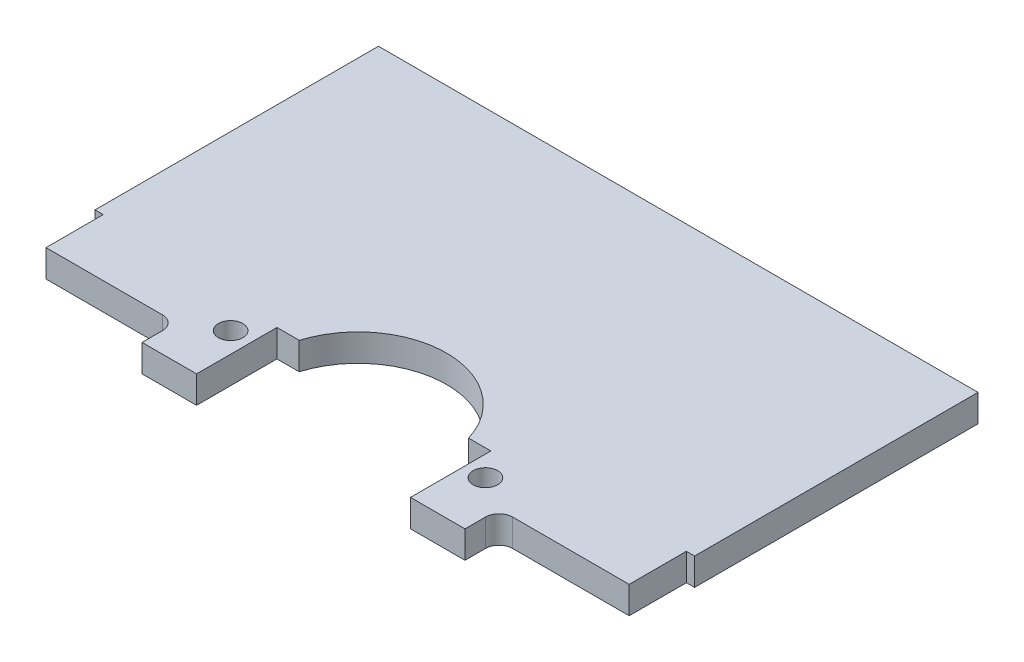
ISO-10303-21;
HEADER;
FILE_DESCRIPTION(('STEP AP214'),'2;1');
FILE_NAME('part.step','',(''),(''),'','','');
FILE_SCHEMA(('AUTOMOTIVE_DESIGN { 1 0 10303 214 1 1 1 1 }'));
ENDSEC;
DATA;
#1=APPLICATION_CONTEXT('core data for automotive mechanical design processes');
#2=APPLICATION_PROTOCOL_DEFINITION('international standard','automotive_design',2000,#1);
#3=PRODUCT_CONTEXT('',#1,'mechanical');
#4=PRODUCT('Part','Part','',(#3));
#5=PRODUCT_RELATED_PRODUCT_CATEGORY('part','',(#4));
#6=PRODUCT_DEFINITION_FORMATION('','',#4);
#7=PRODUCT_DEFINITION_CONTEXT('part definition',#1,'design');
#8=PRODUCT_DEFINITION('design','',#6,#7);
#9=PRODUCT_DEFINITION_SHAPE('','',#8);
#10=(LENGTH_UNIT() NAMED_UNIT(*) SI_UNIT(.MILLI.,.METRE.));
#11=(NAMED_UNIT(*) PLANE_ANGLE_UNIT() SI_UNIT($,.RADIAN.));
#12=(NAMED_UNIT(*) SI_UNIT($,.STERADIAN.) SOLID_ANGLE_UNIT());
#13=UNCERTAINTY_MEASURE_WITH_UNIT(LENGTH_MEASURE(1.E-05),#10,'distance_accuracy_value','');
#14=(GEOMETRIC_REPRESENTATION_CONTEXT(3) GLOBAL_UNCERTAINTY_ASSIGNED_CONTEXT((#13)) GLOBAL_UNIT_ASSIGNED_CONTEXT((#10,
#11,#12)) REPRESENTATION_CONTEXT('',''));
#15=CARTESIAN_POINT('',(0.,0.,0.));
#16=DIRECTION('',(0.,0.,1.));
#17=DIRECTION('',(1.,0.,0.));
#18=AXIS2_PLACEMENT_3D('',#15,#16,#17);
#19=CARTESIAN_POINT('',(0.,2.54,13.208));
#20=DIRECTION('',(0.,0.,-1.));
#21=DIRECTION('',(-1.,0.,0.));
#22=AXIS2_PLACEMENT_3D('',#19,#20,#21);
#23=PLANE('',#22);
#24=DIRECTION('',(1.,0.,0.));
#25=VECTOR('',#24,1.);
#26=CARTESIAN_POINT('',(0.,0.,13.208));
#27=LINE('',#26,#25);
#28=CARTESIAN_POINT('',(-27.94,0.,13.208));
#29=VERTEX_POINT('',#28);
#30=CARTESIAN_POINT('',(-27.178,0.,13.208));
#31=VERTEX_POINT('',#30);
#32=EDGE_CURVE('E188',#29,#31,#27,.T.);
#33=ORIENTED_EDGE('',*,*,#32,.T.);
#34=DIRECTION('',(0.,-1.,0.));
#35=VECTOR('',#34,1.);
#36=CARTESIAN_POINT('',(-27.178,2.54,13.208));
#37=LINE('',#36,#35);
#38=CARTESIAN_POINT('',(-27.178,2.54,13.208));
#39=VERTEX_POINT('',#38);
#40=EDGE_CURVE('E186',#39,#31,#37,.T.);
#41=ORIENTED_EDGE('',*,*,#40,.F.);
#42=DIRECTION('',(1.,0.,0.));
#43=VECTOR('',#42,1.);
#44=CARTESIAN_POINT('',(0.,2.54,13.208));
#45=LINE('',#44,#43);
#46=CARTESIAN_POINT('',(-27.94,2.54,13.208));
#47=VERTEX_POINT('',#46);
#48=EDGE_CURVE('E171',#47,#39,#45,.T.);
#49=ORIENTED_EDGE('',*,*,#48,.F.);
#50=DIRECTION('',(0.,-1.,0.));
#51=VECTOR('',#50,1.);
#52=CARTESIAN_POINT('',(-27.94,2.54,13.208));
#53=LINE('',#52,#51);
#54=EDGE_CURVE('E236',#47,#29,#53,.T.);
#55=ORIENTED_EDGE('',*,*,#54,.T.);
#56=EDGE_LOOP('',(#33,#41,#49,#55));
#57=FACE_BOUND('',#56,.T.);
#58=ADVANCED_FACE('F33',(#57),#23,.F.);
#59=CARTESIAN_POINT('',(-27.178,2.54,0.));
#60=DIRECTION('',(-1.,0.,0.));
#61=DIRECTION('',(0.,0.,1.));
#62=AXIS2_PLACEMENT_3D('',#59,#60,#61);
#63=PLANE('',#62);
#64=DIRECTION('',(0.,0.,-1.));
#65=VECTOR('',#64,1.);
#66=CARTESIAN_POINT('',(-27.178,0.,0.));
#67=LINE('',#66,#65);
#68=CARTESIAN_POINT('',(-27.178,0.,18.542));
#69=VERTEX_POINT('',#68);
#70=EDGE_CURVE('E238',#69,#31,#67,.T.);
#71=ORIENTED_EDGE('',*,*,#70,.F.);
#72=DIRECTION('',(0.,-1.,0.));
#73=VECTOR('',#72,1.);
#74=CARTESIAN_POINT('',(-27.178,2.54,18.542));
#75=LINE('',#74,#73);
#76=CARTESIAN_POINT('',(-27.178,2.54,18.542));
#77=VERTEX_POINT('',#76);
#78=EDGE_CURVE('E193',#77,#69,#75,.T.);
#79=ORIENTED_EDGE('',*,*,#78,.F.);
#80=DIRECTION('',(0.,0.,-1.));
#81=VECTOR('',#80,1.);
#82=CARTESIAN_POINT('',(-27.178,2.54,0.));
#83=LINE('',#82,#81);
#84=EDGE_CURVE('E177',#77,#39,#83,.T.);
#85=ORIENTED_EDGE('',*,*,#84,.T.);
#86=ORIENTED_EDGE('',*,*,#40,.T.);
#87=EDGE_LOOP('',(#71,#79,#85,#86));
#88=FACE_BOUND('',#87,.T.);
#89=ADVANCED_FACE('F195',(#88),#63,.T.);
#90=CARTESIAN_POINT('',(0.,2.54,18.542));
#91=DIRECTION('',(0.,0.,-1.));
#92=DIRECTION('',(-1.,0.,0.));
#93=AXIS2_PLACEMENT_3D('',#90,#91,#92);
#94=PLANE('',#93);
#95=DIRECTION('',(1.,0.,0.));
#96=VECTOR('',#95,1.);
#97=CARTESIAN_POINT('',(0.,0.,18.542));
#98=LINE('',#97,#96);
#99=CARTESIAN_POINT('',(-16.3195,0.,18.542));
#100=VERTEX_POINT('',#99);
#101=EDGE_CURVE('E241',#69,#100,#98,.T.);
#102=ORIENTED_EDGE('',*,*,#101,.T.);
#103=DIRECTION('',(0.,-1.,0.));
#104=VECTOR('',#103,1.);
#105=CARTESIAN_POINT('',(-16.3195,2.54,18.542));
#106=LINE('',#105,#104);
#107=CARTESIAN_POINT('',(-16.3195,2.54,18.542));
#108=VERTEX_POINT('',#107);
#109=EDGE_CURVE('E321',#100,#108,#106,.F.);
#110=ORIENTED_EDGE('',*,*,#109,.T.);
#111=DIRECTION('',(1.,0.,0.));
#112=VECTOR('',#111,1.);
#113=CARTESIAN_POINT('',(0.,2.54,18.542));
#114=LINE('',#113,#112);
#115=EDGE_CURVE('E197',#77,#108,#114,.T.);
#116=ORIENTED_EDGE('',*,*,#115,.F.);
#117=ORIENTED_EDGE('',*,*,#78,.T.);
#118=EDGE_LOOP('',(#102,#110,#116,#117));
#119=FACE_BOUND('',#118,.T.);
#120=ADVANCED_FACE('F345',(#119),#94,.F.);
#121=CARTESIAN_POINT('',(-15.0495,2.54,0.));
#122=DIRECTION('',(-1.,0.,0.));
#123=DIRECTION('',(0.,0.,1.));
#124=AXIS2_PLACEMENT_3D('',#121,#122,#123);
#125=PLANE('',#124);
#126=DIRECTION('',(0.,0.,-1.));
#127=VECTOR('',#126,1.);
#128=CARTESIAN_POINT('',(-15.0495,2.54,0.));
#129=LINE('',#128,#127);
#130=CARTESIAN_POINT('',(-15.0495,2.54,21.717));
#131=VERTEX_POINT('',#130);
#132=CARTESIAN_POINT('',(-15.0495,2.54,19.812));
#133=VERTEX_POINT('',#132);
#134=EDGE_CURVE('E199',#131,#133,#129,.T.);
#135=ORIENTED_EDGE('',*,*,#134,.T.);
#136=DIRECTION('',(0.,-1.,0.));
#137=VECTOR('',#136,1.);
#138=CARTESIAN_POINT('',(-15.0495,2.54,19.812));
#139=LINE('',#138,#137);
#140=CARTESIAN_POINT('',(-15.0495,0.,19.812));
#141=VERTEX_POINT('',#140);
#142=EDGE_CURVE('E192',#133,#141,#139,.T.);
#143=ORIENTED_EDGE('',*,*,#142,.T.);
#144=DIRECTION('',(0.,0.,-1.));
#145=VECTOR('',#144,1.);
#146=CARTESIAN_POINT('',(-15.0495,0.,0.));
#147=LINE('',#146,#145);
#148=CARTESIAN_POINT('',(-15.0495,0.,21.717));
#149=VERTEX_POINT('',#148);
#150=EDGE_CURVE('E244',#149,#141,#147,.T.);
#151=ORIENTED_EDGE('',*,*,#150,.F.);
#152=DIRECTION('',(0.,-1.,0.));
#153=VECTOR('',#152,1.);
#154=CARTESIAN_POINT('',(-15.0495,2.54,21.717));
#155=LINE('',#154,#153);
#156=EDGE_CURVE('E316',#131,#149,#155,.T.);
#157=ORIENTED_EDGE('',*,*,#156,.F.);
#158=EDGE_LOOP('',(#135,#143,#151,#157));
#159=FACE_BOUND('',#158,.T.);
#160=ADVANCED_FACE('F336',(#159),#125,.T.);
#161=CARTESIAN_POINT('',(0.,2.54,21.717));
#162=DIRECTION('',(0.,0.,-1.));
#163=DIRECTION('',(-1.,0.,0.));
#164=AXIS2_PLACEMENT_3D('',#161,#162,#163);
#165=PLANE('',#164);
#166=DIRECTION('',(1.,0.,0.));
#167=VECTOR('',#166,1.);
#168=CARTESIAN_POINT('',(0.,0.,21.717));
#169=LINE('',#168,#167);
#170=CARTESIAN_POINT('',(-9.9695,0.,21.717));
#171=VERTEX_POINT('',#170);
#172=EDGE_CURVE('E247',#149,#171,#169,.T.);
#173=ORIENTED_EDGE('',*,*,#172,.T.);
#174=DIRECTION('',(0.,-1.,0.));
#175=VECTOR('',#174,1.);
#176=CARTESIAN_POINT('',(-9.9695,2.54,21.717));
#177=LINE('',#176,#175);
#178=CARTESIAN_POINT('',(-9.9695,2.54,21.717));
#179=VERTEX_POINT('',#178);
#180=EDGE_CURVE('E313',#179,#171,#177,.T.);
#181=ORIENTED_EDGE('',*,*,#180,.F.);
#182=DIRECTION('',(1.,0.,0.));
#183=VECTOR('',#182,1.);
#184=CARTESIAN_POINT('',(0.,2.54,21.717));
#185=LINE('',#184,#183);
#186=EDGE_CURVE('E204',#131,#179,#185,.T.);
#187=ORIENTED_EDGE('',*,*,#186,.F.);
#188=ORIENTED_EDGE('',*,*,#156,.T.);
#189=EDGE_LOOP('',(#173,#181,#187,#188));
#190=FACE_BOUND('',#189,.T.);
#191=ADVANCED_FACE('F352',(#190),#165,.F.);
#192=CARTESIAN_POINT('',(-9.9695,2.54,0.));
#193=DIRECTION('',(-1.,0.,0.));
#194=DIRECTION('',(0.,0.,1.));
#195=AXIS2_PLACEMENT_3D('',#192,#193,#194);
#196=PLANE('',#195);
#197=DIRECTION('',(0.,0.,-1.));
#198=VECTOR('',#197,1.);
#199=CARTESIAN_POINT('',(-9.9695,0.,0.));
#200=LINE('',#199,#198);
#201=CARTESIAN_POINT('',(-9.9695,0.,14.224));
#202=VERTEX_POINT('',#201);
#203=EDGE_CURVE('E249',#171,#202,#200,.T.);
#204=ORIENTED_EDGE('',*,*,#203,.T.);
#205=DIRECTION('',(0.,-1.,0.));
#206=VECTOR('',#205,1.);
#207=CARTESIAN_POINT('',(-9.9695,2.54,14.224));
#208=LINE('',#207,#206);
#209=CARTESIAN_POINT('',(-9.9695,2.54,14.224));
#210=VERTEX_POINT('',#209);
#211=EDGE_CURVE('E310',#210,#202,#208,.T.);
#212=ORIENTED_EDGE('',*,*,#211,.F.);
#213=DIRECTION('',(0.,0.,-1.));
#214=VECTOR('',#213,1.);
#215=CARTESIAN_POINT('',(-9.9695,2.54,0.));
#216=LINE('',#215,#214);
#217=EDGE_CURVE('E206',#179,#210,#216,.T.);
#218=ORIENTED_EDGE('',*,*,#217,.F.);
#219=ORIENTED_EDGE('',*,*,#180,.T.);
#220=EDGE_LOOP('',(#204,#212,#218,#219));
#221=FACE_BOUND('',#220,.T.);
#222=ADVANCED_FACE('F527',(#221),#196,.F.);
#223=CARTESIAN_POINT('',(0.,2.54,14.224));
#224=DIRECTION('',(0.,0.,-1.));
#225=DIRECTION('',(-1.,0.,0.));
#226=AXIS2_PLACEMENT_3D('',#223,#224,#225);
#227=PLANE('',#226);
#228=DIRECTION('',(1.,0.,0.));
#229=VECTOR('',#228,1.);
#230=CARTESIAN_POINT('',(0.,0.,14.224));
#231=LINE('',#230,#229);
#232=CARTESIAN_POINT('',(-7.89445729610339,0.,14.224));
#233=VERTEX_POINT('',#232);
#234=EDGE_CURVE('E251',#202,#233,#231,.T.);
#235=ORIENTED_EDGE('',*,*,#234,.T.);
#236=DIRECTION('',(0.,-1.,0.));
#237=VECTOR('',#236,1.);
#238=CARTESIAN_POINT('',(-7.89445729610339,2.54,14.224));
#239=LINE('',#238,#237);
#240=CARTESIAN_POINT('',(-7.89445729610339,2.54,14.224));
#241=VERTEX_POINT('',#240);
#242=EDGE_CURVE('E307',#241,#233,#239,.T.);
#243=ORIENTED_EDGE('',*,*,#242,.F.);
#244=DIRECTION('',(1.,0.,0.));
#245=VECTOR('',#244,1.);
#246=CARTESIAN_POINT('',(0.,2.54,14.224));
#247=LINE('',#246,#245);
#248=EDGE_CURVE('E208',#210,#241,#247,.T.);
#249=ORIENTED_EDGE('',*,*,#248,.F.);
#250=ORIENTED_EDGE('',*,*,#211,.T.);
#251=EDGE_LOOP('',(#235,#243,#249,#250));
#252=FACE_BOUND('',#251,.T.);
#253=ADVANCED_FACE('F523',(#252),#227,.F.);
#254=CARTESIAN_POINT('',(0.,2.54,16.637));
#255=DIRECTION('',(0.,-1.,0.));
#256=DIRECTION('',(0.,0.,-1.));
#257=AXIS2_PLACEMENT_3D('',#254,#255,#256);
#258=CYLINDRICAL_SURFACE('',#257,8.255);
#259=CARTESIAN_POINT('',(0.,0.,16.637));
#260=DIRECTION('',(0.,1.,0.));
#261=DIRECTION('',(0.,0.,1.));
#262=AXIS2_PLACEMENT_3D('',#259,#260,#261);
#263=CIRCLE('',#262,8.255);
#264=CARTESIAN_POINT('',(7.89445729610339,0.,14.224));
#265=VERTEX_POINT('',#264);
#266=EDGE_CURVE('E253',#233,#265,#263,.F.);
#267=ORIENTED_EDGE('',*,*,#266,.T.);
#268=DIRECTION('',(0.,-1.,0.));
#269=VECTOR('',#268,1.);
#270=CARTESIAN_POINT('',(7.89445729610339,2.54,14.224));
#271=LINE('',#270,#269);
#272=CARTESIAN_POINT('',(7.89445729610339,2.54,14.224));
#273=VERTEX_POINT('',#272);
#274=EDGE_CURVE('E304',#273,#265,#271,.T.);
#275=ORIENTED_EDGE('',*,*,#274,.F.);
#276=CARTESIAN_POINT('',(0.,2.54,16.637));
#277=DIRECTION('',(0.,1.,0.));
#278=DIRECTION('',(0.,0.,1.));
#279=AXIS2_PLACEMENT_3D('',#276,#277,#278);
#280=CIRCLE('',#279,8.255);
#281=EDGE_CURVE('E210',#241,#273,#280,.F.);
#282=ORIENTED_EDGE('',*,*,#281,.F.);
#283=ORIENTED_EDGE('',*,*,#242,.T.);
#284=EDGE_LOOP('',(#267,#275,#282,#283));
#285=FACE_BOUND('',#284,.T.);
#286=ADVANCED_FACE('F518',(#285),#258,.F.);
#287=CARTESIAN_POINT('',(0.,2.54,14.224));
#288=DIRECTION('',(0.,0.,-1.));
#289=DIRECTION('',(-1.,0.,0.));
#290=AXIS2_PLACEMENT_3D('',#287,#288,#289);
#291=PLANE('',#290);
#292=DIRECTION('',(1.,0.,0.));
#293=VECTOR('',#292,1.);
#294=CARTESIAN_POINT('',(0.,0.,14.224));
#295=LINE('',#294,#293);
#296=CARTESIAN_POINT('',(9.9695,0.,14.224));
#297=VERTEX_POINT('',#296);
#298=EDGE_CURVE('E255',#265,#297,#295,.T.);
#299=ORIENTED_EDGE('',*,*,#298,.T.);
#300=DIRECTION('',(0.,-1.,0.));
#301=VECTOR('',#300,1.);
#302=CARTESIAN_POINT('',(9.9695,2.54,14.224));
#303=LINE('',#302,#301);
#304=CARTESIAN_POINT('',(9.9695,2.54,14.224));
#305=VERTEX_POINT('',#304);
#306=EDGE_CURVE('E301',#305,#297,#303,.T.);
#307=ORIENTED_EDGE('',*,*,#306,.F.);
#308=DIRECTION('',(1.,0.,0.));
#309=VECTOR('',#308,1.);
#310=CARTESIAN_POINT('',(0.,2.54,14.224));
#311=LINE('',#310,#309);
#312=EDGE_CURVE('E212',#273,#305,#311,.T.);
#313=ORIENTED_EDGE('',*,*,#312,.F.);
#314=ORIENTED_EDGE('',*,*,#274,.T.);
#315=EDGE_LOOP('',(#299,#307,#313,#314));
#316=FACE_BOUND('',#315,.T.);
#317=ADVANCED_FACE('F512',(#316),#291,.F.);
#318=CARTESIAN_POINT('',(9.9695,2.54,0.));
#319=DIRECTION('',(1.,0.,0.));
#320=DIRECTION('',(0.,0.,-1.));
#321=AXIS2_PLACEMENT_3D('',#318,#319,#320);
#322=PLANE('',#321);
#323=DIRECTION('',(0.,0.,1.));
#324=VECTOR('',#323,1.);
#325=CARTESIAN_POINT('',(9.9695,0.,0.));
#326=LINE('',#325,#324);
#327=CARTESIAN_POINT('',(9.9695,0.,21.717));
#328=VERTEX_POINT('',#327);
#329=EDGE_CURVE('E257',#297,#328,#326,.T.);
#330=ORIENTED_EDGE('',*,*,#329,.T.);
#331=DIRECTION('',(0.,-1.,0.));
#332=VECTOR('',#331,1.);
#333=CARTESIAN_POINT('',(9.9695,2.54,21.717));
#334=LINE('',#333,#332);
#335=CARTESIAN_POINT('',(9.9695,2.54,21.717));
#336=VERTEX_POINT('',#335);
#337=EDGE_CURVE('E298',#336,#328,#334,.T.);
#338=ORIENTED_EDGE('',*,*,#337,.F.);
#339=DIRECTION('',(0.,0.,1.));
#340=VECTOR('',#339,1.);
#341=CARTESIAN_POINT('',(9.9695,2.54,0.));
#342=LINE('',#341,#340);
#343=EDGE_CURVE('E214',#305,#336,#342,.T.);
#344=ORIENTED_EDGE('',*,*,#343,.F.);
#345=ORIENTED_EDGE('',*,*,#306,.T.);
#346=EDGE_LOOP('',(#330,#338,#344,#345));
#347=FACE_BOUND('',#346,.T.);
#348=ADVANCED_FACE('F508',(#347),#322,.F.);
#349=CARTESIAN_POINT('',(0.,2.54,21.717));
#350=DIRECTION('',(0.,0.,-1.));
#351=DIRECTION('',(-1.,0.,0.));
#352=AXIS2_PLACEMENT_3D('',#349,#350,#351);
#353=PLANE('',#352);
#354=DIRECTION('',(1.,0.,0.));
#355=VECTOR('',#354,1.);
#356=CARTESIAN_POINT('',(0.,0.,21.717));
#357=LINE('',#356,#355);
#358=CARTESIAN_POINT('',(15.0495,0.,21.717));
#359=VERTEX_POINT('',#358);
#360=EDGE_CURVE('E259',#328,#359,#357,.T.);
#361=ORIENTED_EDGE('',*,*,#360,.T.);
#362=DIRECTION('',(0.,-1.,0.));
#363=VECTOR('',#362,1.);
#364=CARTESIAN_POINT('',(15.0495,2.54,21.717));
#365=LINE('',#364,#363);
#366=CARTESIAN_POINT('',(15.0495,2.54,21.717));
#367=VERTEX_POINT('',#366);
#368=EDGE_CURVE('E295',#367,#359,#365,.T.);
#369=ORIENTED_EDGE('',*,*,#368,.F.);
#370=DIRECTION('',(1.,0.,0.));
#371=VECTOR('',#370,1.);
#372=CARTESIAN_POINT('',(0.,2.54,21.717));
#373=LINE('',#372,#371);
#374=EDGE_CURVE('E216',#336,#367,#373,.T.);
#375=ORIENTED_EDGE('',*,*,#374,.F.);
#376=ORIENTED_EDGE('',*,*,#337,.T.);
#377=EDGE_LOOP('',(#361,#369,#375,#376));
#378=FACE_BOUND('',#377,.T.);
#379=ADVANCED_FACE('F444',(#378),#353,.F.);
#380=CARTESIAN_POINT('',(15.0495,2.54,0.));
#381=DIRECTION('',(-1.,0.,0.));
#382=DIRECTION('',(0.,0.,1.));
#383=AXIS2_PLACEMENT_3D('',#380,#381,#382);
#384=PLANE('',#383);
#385=DIRECTION('',(0.,0.,-1.));
#386=VECTOR('',#385,1.);
#387=CARTESIAN_POINT('',(15.0495,0.,0.));
#388=LINE('',#387,#386);
#389=CARTESIAN_POINT('',(15.0495,0.,19.812));
#390=VERTEX_POINT('',#389);
#391=EDGE_CURVE('E261',#359,#390,#388,.T.);
#392=ORIENTED_EDGE('',*,*,#391,.T.);
#393=DIRECTION('',(0.,-1.,0.));
#394=VECTOR('',#393,1.);
#395=CARTESIAN_POINT('',(15.0495,2.54,19.812));
#396=LINE('',#395,#394);
#397=CARTESIAN_POINT('',(15.0495,2.54,19.812));
#398=VERTEX_POINT('',#397);
#399=EDGE_CURVE('E48',#390,#398,#396,.F.);
#400=ORIENTED_EDGE('',*,*,#399,.T.);
#401=DIRECTION('',(0.,0.,-1.));
#402=VECTOR('',#401,1.);
#403=CARTESIAN_POINT('',(15.0495,2.54,0.));
#404=LINE('',#403,#402);
#405=EDGE_CURVE('E218',#367,#398,#404,.T.);
#406=ORIENTED_EDGE('',*,*,#405,.F.);
#407=ORIENTED_EDGE('',*,*,#368,.T.);
#408=EDGE_LOOP('',(#392,#400,#406,#407));
#409=FACE_BOUND('',#408,.T.);
#410=ADVANCED_FACE('F439',(#409),#384,.F.);
#411=CARTESIAN_POINT('',(0.,2.54,18.542));
#412=DIRECTION('',(0.,0.,-1.));
#413=DIRECTION('',(-1.,0.,0.));
#414=AXIS2_PLACEMENT_3D('',#411,#412,#413);
#415=PLANE('',#414);
#416=DIRECTION('',(1.,0.,0.));
#417=VECTOR('',#416,1.);
#418=CARTESIAN_POINT('',(0.,2.54,18.542));
#419=LINE('',#418,#417);
#420=CARTESIAN_POINT('',(16.3195,2.54,18.542));
#421=VERTEX_POINT('',#420);
#422=CARTESIAN_POINT('',(27.178,2.54,18.542));
#423=VERTEX_POINT('',#422);
#424=EDGE_CURVE('E220',#421,#423,#419,.T.);
#425=ORIENTED_EDGE('',*,*,#424,.F.);
#426=DIRECTION('',(0.,-1.,0.));
#427=VECTOR('',#426,1.);
#428=CARTESIAN_POINT('',(16.3195,0.,18.542));
#429=LINE('',#428,#427);
#430=CARTESIAN_POINT('',(16.3195,0.,18.542));
#431=VERTEX_POINT('',#430);
#432=EDGE_CURVE('E323',#421,#431,#429,.T.);
#433=ORIENTED_EDGE('',*,*,#432,.T.);
#434=DIRECTION('',(1.,0.,0.));
#435=VECTOR('',#434,1.);
#436=CARTESIAN_POINT('',(0.,0.,18.542));
#437=LINE('',#436,#435);
#438=CARTESIAN_POINT('',(27.178,0.,18.542));
#439=VERTEX_POINT('',#438);
#440=EDGE_CURVE('E263',#431,#439,#437,.T.);
#441=ORIENTED_EDGE('',*,*,#440,.T.);
#442=DIRECTION('',(0.,-1.,0.));
#443=VECTOR('',#442,1.);
#444=CARTESIAN_POINT('',(27.178,2.54,18.542));
#445=LINE('',#444,#443);
#446=EDGE_CURVE('E292',#423,#439,#445,.T.);
#447=ORIENTED_EDGE('',*,*,#446,.F.);
#448=EDGE_LOOP('',(#425,#433,#441,#447));
#449=FACE_BOUND('',#448,.T.);
#450=ADVANCED_FACE('F372',(#449),#415,.F.);
#451=CARTESIAN_POINT('',(27.178,2.54,0.));
#452=DIRECTION('',(-1.,0.,0.));
#453=DIRECTION('',(0.,0.,1.));
#454=AXIS2_PLACEMENT_3D('',#451,#452,#453);
#455=PLANE('',#454);
#456=DIRECTION('',(0.,0.,-1.));
#457=VECTOR('',#456,1.);
#458=CARTESIAN_POINT('',(27.178,0.,0.));
#459=LINE('',#458,#457);
#460=CARTESIAN_POINT('',(27.178,0.,13.208));
#461=VERTEX_POINT('',#460);
#462=EDGE_CURVE('E265',#439,#461,#459,.T.);
#463=ORIENTED_EDGE('',*,*,#462,.T.);
#464=DIRECTION('',(0.,-1.,0.));
#465=VECTOR('',#464,1.);
#466=CARTESIAN_POINT('',(27.178,2.54,13.208));
#467=LINE('',#466,#465);
#468=CARTESIAN_POINT('',(27.178,2.54,13.208));
#469=VERTEX_POINT('',#468);
#470=EDGE_CURVE('E289',#469,#461,#467,.T.);
#471=ORIENTED_EDGE('',*,*,#470,.F.);
#472=DIRECTION('',(0.,0.,-1.));
#473=VECTOR('',#472,1.);
#474=CARTESIAN_POINT('',(27.178,2.54,0.));
#475=LINE('',#474,#473);
#476=EDGE_CURVE('E222',#423,#469,#475,.T.);
#477=ORIENTED_EDGE('',*,*,#476,.F.);
#478=ORIENTED_EDGE('',*,*,#446,.T.);
#479=EDGE_LOOP('',(#463,#471,#477,#478));
#480=FACE_BOUND('',#479,.T.);
#481=ADVANCED_FACE('F364',(#480),#455,.F.);
#482=CARTESIAN_POINT('',(27.94,0.,13.208));
#483=VERTEX_POINT('',#482);
#484=EDGE_CURVE('E239',#461,#483,#27,.T.);
#485=ORIENTED_EDGE('',*,*,#484,.T.);
#486=DIRECTION('',(0.,-1.,0.));
#487=VECTOR('',#486,1.);
#488=CARTESIAN_POINT('',(27.94,2.54,13.208));
#489=LINE('',#488,#487);
#490=CARTESIAN_POINT('',(27.94,2.54,13.208));
#491=VERTEX_POINT('',#490);
#492=EDGE_CURVE('E286',#491,#483,#489,.T.);
#493=ORIENTED_EDGE('',*,*,#492,.F.);
#494=EDGE_CURVE('E184',#469,#491,#45,.T.);
#495=ORIENTED_EDGE('',*,*,#494,.F.);
#496=ORIENTED_EDGE('',*,*,#470,.T.);
#497=EDGE_LOOP('',(#485,#493,#495,#496));
#498=FACE_BOUND('',#497,.T.);
#499=ADVANCED_FACE('F357',(#498),#23,.F.);
#500=CARTESIAN_POINT('',(27.94,2.54,0.));
#501=DIRECTION('',(-1.,0.,0.));
#502=DIRECTION('',(0.,0.,1.));
#503=AXIS2_PLACEMENT_3D('',#500,#501,#502);
#504=PLANE('',#503);
#505=DIRECTION('',(0.,0.,-1.));
#506=VECTOR('',#505,1.);
#507=CARTESIAN_POINT('',(27.94,0.,0.));
#508=LINE('',#507,#506);
#509=CARTESIAN_POINT('',(27.94,0.,-13.208));
#510=VERTEX_POINT('',#509);
#511=EDGE_CURVE('E267',#483,#510,#508,.T.);
#512=ORIENTED_EDGE('',*,*,#511,.T.);
#513=DIRECTION('',(0.,-1.,0.));
#514=VECTOR('',#513,1.);
#515=CARTESIAN_POINT('',(27.94,2.54,-13.208));
#516=LINE('',#515,#514);
#517=CARTESIAN_POINT('',(27.94,2.54,-13.208));
#518=VERTEX_POINT('',#517);
#519=EDGE_CURVE('E284',#518,#510,#516,.T.);
#520=ORIENTED_EDGE('',*,*,#519,.F.);
#521=DIRECTION('',(0.,0.,-1.));
#522=VECTOR('',#521,1.);
#523=CARTESIAN_POINT('',(27.94,2.54,0.));
#524=LINE('',#523,#522);
#525=EDGE_CURVE('E224',#491,#518,#524,.T.);
#526=ORIENTED_EDGE('',*,*,#525,.F.);
#527=ORIENTED_EDGE('',*,*,#492,.T.);
#528=EDGE_LOOP('',(#512,#520,#526,#527));
#529=FACE_BOUND('',#528,.T.);
#530=ADVANCED_FACE('F363',(#529),#504,.F.);
#531=CARTESIAN_POINT('',(0.,2.54,-13.208));
#532=DIRECTION('',(0.,0.,-1.));
#533=DIRECTION('',(-1.,0.,0.));
#534=AXIS2_PLACEMENT_3D('',#531,#532,#533);
#535=PLANE('',#534);
#536=DIRECTION('',(1.,0.,0.));
#537=VECTOR('',#536,1.);
#538=CARTESIAN_POINT('',(0.,0.,-13.208));
#539=LINE('',#538,#537);
#540=CARTESIAN_POINT('',(-27.94,0.,-13.208));
#541=VERTEX_POINT('',#540);
#542=EDGE_CURVE('E270',#541,#510,#539,.T.);
#543=ORIENTED_EDGE('',*,*,#542,.F.);
#544=DIRECTION('',(0.,-1.,0.));
#545=VECTOR('',#544,1.);
#546=CARTESIAN_POINT('',(-27.94,2.54,-13.208));
#547=LINE('',#546,#545);
#548=CARTESIAN_POINT('',(-27.94,2.54,-13.208));
#549=VERTEX_POINT('',#548);
#550=EDGE_CURVE('E282',#549,#541,#547,.T.);
#551=ORIENTED_EDGE('',*,*,#550,.F.);
#552=DIRECTION('',(1.,0.,0.));
#553=VECTOR('',#552,1.);
#554=CARTESIAN_POINT('',(0.,2.54,-13.208));
#555=LINE('',#554,#553);
#556=EDGE_CURVE('E226',#549,#518,#555,.T.);
#557=ORIENTED_EDGE('',*,*,#556,.T.);
#558=ORIENTED_EDGE('',*,*,#519,.T.);
#559=EDGE_LOOP('',(#543,#551,#557,#558));
#560=FACE_BOUND('',#559,.T.);
#561=ADVANCED_FACE('F370',(#560),#535,.T.);
#562=CARTESIAN_POINT('',(11.8745,2.54,16.637));
#563=DIRECTION('',(0.,-1.,0.));
#564=DIRECTION('',(0.,0.,-1.));
#565=AXIS2_PLACEMENT_3D('',#562,#563,#564);
#566=CYLINDRICAL_SURFACE('',#565,1.143);
#567=CARTESIAN_POINT('',(11.8745,2.54,16.637));
#568=DIRECTION('',(0.,1.,0.));
#569=DIRECTION('',(0.,0.,1.));
#570=AXIS2_PLACEMENT_3D('',#567,#568,#569);
#571=CIRCLE('',#570,1.143);
#572=CARTESIAN_POINT('',(11.8745,2.54,17.78));
#573=VERTEX_POINT('',#572);
#574=EDGE_CURVE('E230',#573,#573,#571,.T.);
#575=ORIENTED_EDGE('',*,*,#574,.T.);
#576=EDGE_LOOP('',(#575));
#577=FACE_BOUND('',#576,.T.);
#578=CARTESIAN_POINT('',(11.8745,0.,16.637));
#579=DIRECTION('',(0.,1.,0.));
#580=DIRECTION('',(0.,0.,1.));
#581=AXIS2_PLACEMENT_3D('',#578,#579,#580);
#582=CIRCLE('',#581,1.143);
#583=CARTESIAN_POINT('',(11.8745,0.,17.78));
#584=VERTEX_POINT('',#583);
#585=EDGE_CURVE('E276',#584,#584,#582,.T.);
#586=ORIENTED_EDGE('',*,*,#585,.F.);
#587=EDGE_LOOP('',(#586));
#588=FACE_BOUND('',#587,.T.);
#589=ADVANCED_FACE('F389',(#577,#588),#566,.F.);
#590=CARTESIAN_POINT('',(-27.94,2.54,0.));
#591=DIRECTION('',(-1.,0.,0.));
#592=DIRECTION('',(0.,0.,1.));
#593=AXIS2_PLACEMENT_3D('',#590,#591,#592);
#594=PLANE('',#593);
#595=DIRECTION('',(0.,0.,-1.));
#596=VECTOR('',#595,1.);
#597=CARTESIAN_POINT('',(-27.94,0.,0.));
#598=LINE('',#597,#596);
#599=EDGE_CURVE('E273',#29,#541,#598,.T.);
#600=ORIENTED_EDGE('',*,*,#599,.F.);
#601=ORIENTED_EDGE('',*,*,#54,.F.);
#602=DIRECTION('',(0.,0.,-1.));
#603=VECTOR('',#602,1.);
#604=CARTESIAN_POINT('',(-27.94,2.54,0.));
#605=LINE('',#604,#603);
#606=EDGE_CURVE('E180',#47,#549,#605,.T.);
#607=ORIENTED_EDGE('',*,*,#606,.T.);
#608=ORIENTED_EDGE('',*,*,#550,.T.);
#609=EDGE_LOOP('',(#600,#601,#607,#608));
#610=FACE_BOUND('',#609,.T.);
#611=ADVANCED_FACE('F386',(#610),#594,.T.);
#612=CARTESIAN_POINT('',(-11.8745,2.54,16.637));
#613=DIRECTION('',(0.,-1.,0.));
#614=DIRECTION('',(0.,0.,-1.));
#615=AXIS2_PLACEMENT_3D('',#612,#613,#614);
#616=CYLINDRICAL_SURFACE('',#615,1.143);
#617=CARTESIAN_POINT('',(-11.8745,2.54,16.637));
#618=DIRECTION('',(0.,1.,0.));
#619=DIRECTION('',(0.,0.,1.));
#620=AXIS2_PLACEMENT_3D('',#617,#618,#619);
#621=CIRCLE('',#620,1.143);
#622=CARTESIAN_POINT('',(-11.8745,2.54,17.78));
#623=VERTEX_POINT('',#622);
#624=EDGE_CURVE('E233',#623,#623,#621,.T.);
#625=ORIENTED_EDGE('',*,*,#624,.T.);
#626=EDGE_LOOP('',(#625));
#627=FACE_BOUND('',#626,.T.);
#628=CARTESIAN_POINT('',(-11.8745,0.,16.637));
#629=DIRECTION('',(0.,1.,0.));
#630=DIRECTION('',(0.,0.,1.));
#631=AXIS2_PLACEMENT_3D('',#628,#629,#630);
#632=CIRCLE('',#631,1.143);
#633=CARTESIAN_POINT('',(-11.8745,0.,17.78));
#634=VERTEX_POINT('',#633);
#635=EDGE_CURVE('E182',#634,#634,#632,.T.);
#636=ORIENTED_EDGE('',*,*,#635,.F.);
#637=EDGE_LOOP('',(#636));
#638=FACE_BOUND('',#637,.T.);
#639=ADVANCED_FACE('F388',(#627,#638),#616,.F.);
#640=CARTESIAN_POINT('',(0.,2.54,0.));
#641=DIRECTION('',(0.,1.,0.));
#642=DIRECTION('',(0.,0.,1.));
#643=AXIS2_PLACEMENT_3D('',#640,#641,#642);
#644=PLANE('',#643);
#645=ORIENTED_EDGE('',*,*,#48,.T.);
#646=ORIENTED_EDGE('',*,*,#84,.F.);
#647=ORIENTED_EDGE('',*,*,#115,.T.);
#648=CARTESIAN_POINT('',(-16.3195,2.54,19.812));
#649=DIRECTION('',(0.,1.,0.));
#650=DIRECTION('',(0.,0.,1.));
#651=AXIS2_PLACEMENT_3D('',#648,#649,#650);
#652=CIRCLE('',#651,1.27);
#653=EDGE_CURVE('E329',#108,#133,#652,.F.);
#654=ORIENTED_EDGE('',*,*,#653,.T.);
#655=ORIENTED_EDGE('',*,*,#134,.F.);
#656=ORIENTED_EDGE('',*,*,#186,.T.);
#657=ORIENTED_EDGE('',*,*,#217,.T.);
#658=ORIENTED_EDGE('',*,*,#248,.T.);
#659=ORIENTED_EDGE('',*,*,#281,.T.);
#660=ORIENTED_EDGE('',*,*,#312,.T.);
#661=ORIENTED_EDGE('',*,*,#343,.T.);
#662=ORIENTED_EDGE('',*,*,#374,.T.);
#663=ORIENTED_EDGE('',*,*,#405,.T.);
#664=CARTESIAN_POINT('',(16.3195,2.54,19.812));
#665=DIRECTION('',(0.,1.,0.));
#666=DIRECTION('',(0.,0.,1.));
#667=AXIS2_PLACEMENT_3D('',#664,#665,#666);
#668=CIRCLE('',#667,1.27);
#669=EDGE_CURVE('E11',#398,#421,#668,.F.);
#670=ORIENTED_EDGE('',*,*,#669,.T.);
#671=ORIENTED_EDGE('',*,*,#424,.T.);
#672=ORIENTED_EDGE('',*,*,#476,.T.);
#673=ORIENTED_EDGE('',*,*,#494,.T.);
#674=ORIENTED_EDGE('',*,*,#525,.T.);
#675=ORIENTED_EDGE('',*,*,#556,.F.);
#676=ORIENTED_EDGE('',*,*,#606,.F.);
#677=EDGE_LOOP('',(#645,#646,#647,#654,#655,#656,#657,#658,#659,#660,#661,#662,#663,#670,#671,
#672,#673,#674,#675,#676));
#678=FACE_BOUND('',#677,.T.);
#679=ORIENTED_EDGE('',*,*,#574,.F.);
#680=EDGE_LOOP('',(#679));
#681=FACE_BOUND('',#680,.T.);
#682=ORIENTED_EDGE('',*,*,#624,.F.);
#683=EDGE_LOOP('',(#682));
#684=FACE_BOUND('',#683,.T.);
#685=ADVANCED_FACE('F173',(#678,#681,#684),#644,.T.);
#686=CARTESIAN_POINT('',(0.,0.,0.));
#687=DIRECTION('',(0.,1.,0.));
#688=DIRECTION('',(0.,0.,1.));
#689=AXIS2_PLACEMENT_3D('',#686,#687,#688);
#690=PLANE('',#689);
#691=ORIENTED_EDGE('',*,*,#32,.F.);
#692=ORIENTED_EDGE('',*,*,#599,.T.);
#693=ORIENTED_EDGE('',*,*,#542,.T.);
#694=ORIENTED_EDGE('',*,*,#511,.F.);
#695=ORIENTED_EDGE('',*,*,#484,.F.);
#696=ORIENTED_EDGE('',*,*,#462,.F.);
#697=ORIENTED_EDGE('',*,*,#440,.F.);
#698=CARTESIAN_POINT('',(16.3195,0.,19.812));
#699=DIRECTION('',(0.,1.,0.));
#700=DIRECTION('',(0.,0.,1.));
#701=AXIS2_PLACEMENT_3D('',#698,#699,#700);
#702=CIRCLE('',#701,1.27);
#703=EDGE_CURVE('E41',#431,#390,#702,.T.);
#704=ORIENTED_EDGE('',*,*,#703,.T.);
#705=ORIENTED_EDGE('',*,*,#391,.F.);
#706=ORIENTED_EDGE('',*,*,#360,.F.);
#707=ORIENTED_EDGE('',*,*,#329,.F.);
#708=ORIENTED_EDGE('',*,*,#298,.F.);
#709=ORIENTED_EDGE('',*,*,#266,.F.);
#710=ORIENTED_EDGE('',*,*,#234,.F.);
#711=ORIENTED_EDGE('',*,*,#203,.F.);
#712=ORIENTED_EDGE('',*,*,#172,.F.);
#713=ORIENTED_EDGE('',*,*,#150,.T.);
#714=CARTESIAN_POINT('',(-16.3195,0.,19.812));
#715=DIRECTION('',(0.,1.,0.));
#716=DIRECTION('',(0.,0.,1.));
#717=AXIS2_PLACEMENT_3D('',#714,#715,#716);
#718=CIRCLE('',#717,1.27);
#719=EDGE_CURVE('E327',#141,#100,#718,.T.);
#720=ORIENTED_EDGE('',*,*,#719,.T.);
#721=ORIENTED_EDGE('',*,*,#101,.F.);
#722=ORIENTED_EDGE('',*,*,#70,.T.);
#723=EDGE_LOOP('',(#691,#692,#693,#694,#695,#696,#697,#704,#705,#706,#707,#708,#709,#710,#711,
#712,#713,#720,#721,#722));
#724=FACE_BOUND('',#723,.T.);
#725=ORIENTED_EDGE('',*,*,#585,.T.);
#726=EDGE_LOOP('',(#725));
#727=FACE_BOUND('',#726,.T.);
#728=ORIENTED_EDGE('',*,*,#635,.T.);
#729=EDGE_LOOP('',(#728));
#730=FACE_BOUND('',#729,.T.);
#731=ADVANCED_FACE('F341',(#724,#727,#730),#690,.F.);
#732=CARTESIAN_POINT('',(-16.3195,2.54,19.812));
#733=DIRECTION('',(0.,-1.,0.));
#734=DIRECTION('',(0.,0.,-1.));
#735=AXIS2_PLACEMENT_3D('',#732,#733,#734);
#736=CYLINDRICAL_SURFACE('',#735,1.27);
#737=ORIENTED_EDGE('',*,*,#653,.F.);
#738=ORIENTED_EDGE('',*,*,#109,.F.);
#739=ORIENTED_EDGE('',*,*,#719,.F.);
#740=ORIENTED_EDGE('',*,*,#142,.F.);
#741=EDGE_LOOP('',(#737,#738,#739,#740));
#742=FACE_BOUND('',#741,.T.);
#743=ADVANCED_FACE('F339',(#742),#736,.F.);
#744=CARTESIAN_POINT('',(16.3195,2.54,19.812));
#745=DIRECTION('',(0.,1.,0.));
#746=DIRECTION('',(0.,0.,1.));
#747=AXIS2_PLACEMENT_3D('',#744,#745,#746);
#748=CYLINDRICAL_SURFACE('',#747,1.27);
#749=ORIENTED_EDGE('',*,*,#669,.F.);
#750=ORIENTED_EDGE('',*,*,#399,.F.);
#751=ORIENTED_EDGE('',*,*,#703,.F.);
#752=ORIENTED_EDGE('',*,*,#432,.F.);
#753=EDGE_LOOP('',(#749,#750,#751,#752));
#754=FACE_BOUND('',#753,.T.);
#755=ADVANCED_FACE('F35',(#754),#748,.F.);
#756=CLOSED_SHELL('',(#58,#89,#120,#160,#191,#222,#253,#286,#317,#348,#379,#410,#450,#481,#499,
#530,#561,#589,#611,#639,#685,#731,#743,#755));
#757=MANIFOLD_SOLID_BREP('B2',#756);
#758=ADVANCED_BREP_SHAPE_REPRESENTATION('',(#18,#757),#14);
#759=SHAPE_DEFINITION_REPRESENTATION(#9,#758);
ENDSEC;
END-ISO-10303-21;
